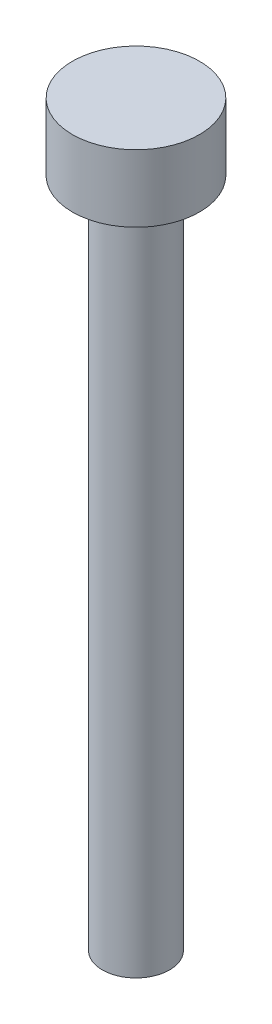
ISO-10303-21;
HEADER;
FILE_DESCRIPTION(('STEP AP214'),'2;1');
FILE_NAME('part.step','',(''),(''),'','','');
FILE_SCHEMA(('AUTOMOTIVE_DESIGN { 1 0 10303 214 1 1 1 1 }'));
ENDSEC;
DATA;
#1=APPLICATION_CONTEXT('core data for automotive mechanical design processes');
#2=APPLICATION_PROTOCOL_DEFINITION('international standard','automotive_design',2000,#1);
#3=PRODUCT_CONTEXT('',#1,'mechanical');
#4=PRODUCT('Part','Part','',(#3));
#5=PRODUCT_RELATED_PRODUCT_CATEGORY('part','',(#4));
#6=PRODUCT_DEFINITION_FORMATION('','',#4);
#7=PRODUCT_DEFINITION_CONTEXT('part definition',#1,'design');
#8=PRODUCT_DEFINITION('design','',#6,#7);
#9=PRODUCT_DEFINITION_SHAPE('','',#8);
#10=(LENGTH_UNIT() NAMED_UNIT(*) SI_UNIT(.MILLI.,.METRE.));
#11=(NAMED_UNIT(*) PLANE_ANGLE_UNIT() SI_UNIT($,.RADIAN.));
#12=(NAMED_UNIT(*) SI_UNIT($,.STERADIAN.) SOLID_ANGLE_UNIT());
#13=UNCERTAINTY_MEASURE_WITH_UNIT(LENGTH_MEASURE(1.E-05),#10,'distance_accuracy_value','');
#14=(GEOMETRIC_REPRESENTATION_CONTEXT(3) GLOBAL_UNCERTAINTY_ASSIGNED_CONTEXT((#13)) GLOBAL_UNIT_ASSIGNED_CONTEXT((#10,
#11,#12)) REPRESENTATION_CONTEXT('',''));
#15=CARTESIAN_POINT('',(0.,0.,0.));
#16=DIRECTION('',(0.,0.,1.));
#17=DIRECTION('',(1.,0.,0.));
#18=AXIS2_PLACEMENT_3D('',#15,#16,#17);
#19=CARTESIAN_POINT('',(0.,30.,0.));
#20=DIRECTION('',(0.,-1.,0.));
#21=DIRECTION('',(0.,0.,-1.));
#22=AXIS2_PLACEMENT_3D('',#19,#20,#21);
#23=CYLINDRICAL_SURFACE('',#22,1.5);
#24=CARTESIAN_POINT('',(0.,30.,0.));
#25=DIRECTION('',(0.,1.,0.));
#26=DIRECTION('',(0.,0.,1.));
#27=AXIS2_PLACEMENT_3D('',#24,#25,#26);
#28=CIRCLE('',#27,1.5);
#29=CARTESIAN_POINT('',(0.,30.,1.5));
#30=VERTEX_POINT('',#29);
#31=EDGE_CURVE('E10',#30,#30,#28,.T.);
#32=ORIENTED_EDGE('',*,*,#31,.F.);
#33=EDGE_LOOP('',(#32));
#34=FACE_BOUND('',#33,.T.);
#35=CARTESIAN_POINT('',(0.,0.,0.));
#36=DIRECTION('',(0.,1.,0.));
#37=DIRECTION('',(0.,0.,1.));
#38=AXIS2_PLACEMENT_3D('',#35,#36,#37);
#39=CIRCLE('',#38,1.5);
#40=CARTESIAN_POINT('',(0.,0.,1.5));
#41=VERTEX_POINT('',#40);
#42=EDGE_CURVE('E34',#41,#41,#39,.T.);
#43=ORIENTED_EDGE('',*,*,#42,.T.);
#44=EDGE_LOOP('',(#43));
#45=FACE_BOUND('',#44,.T.);
#46=ADVANCED_FACE('F31',(#34,#45),#23,.T.);
#47=CARTESIAN_POINT('',(0.,0.,0.));
#48=DIRECTION('',(0.,1.,0.));
#49=DIRECTION('',(0.,0.,1.));
#50=AXIS2_PLACEMENT_3D('',#47,#48,#49);
#51=PLANE('',#50);
#52=ORIENTED_EDGE('',*,*,#42,.F.);
#53=EDGE_LOOP('',(#52));
#54=FACE_BOUND('',#53,.T.);
#55=ADVANCED_FACE('F54',(#54),#51,.F.);
#56=CARTESIAN_POINT('',(0.,33.,0.));
#57=DIRECTION('',(0.,-1.,0.));
#58=DIRECTION('',(0.,0.,-1.));
#59=AXIS2_PLACEMENT_3D('',#56,#57,#58);
#60=CYLINDRICAL_SURFACE('',#59,2.84);
#61=CARTESIAN_POINT('',(0.,33.,0.));
#62=DIRECTION('',(0.,1.,0.));
#63=DIRECTION('',(0.,0.,1.));
#64=AXIS2_PLACEMENT_3D('',#61,#62,#63);
#65=CIRCLE('',#64,2.84);
#66=CARTESIAN_POINT('',(0.,33.,2.84));
#67=VERTEX_POINT('',#66);
#68=EDGE_CURVE('E41',#67,#67,#65,.T.);
#69=ORIENTED_EDGE('',*,*,#68,.F.);
#70=EDGE_LOOP('',(#69));
#71=FACE_BOUND('',#70,.T.);
#72=CARTESIAN_POINT('',(0.,30.,0.));
#73=DIRECTION('',(0.,1.,0.));
#74=DIRECTION('',(0.,0.,1.));
#75=AXIS2_PLACEMENT_3D('',#72,#73,#74);
#76=CIRCLE('',#75,2.84);
#77=CARTESIAN_POINT('',(0.,30.,2.84));
#78=VERTEX_POINT('',#77);
#79=EDGE_CURVE('E43',#78,#78,#76,.T.);
#80=ORIENTED_EDGE('',*,*,#79,.T.);
#81=EDGE_LOOP('',(#80));
#82=FACE_BOUND('',#81,.T.);
#83=ADVANCED_FACE('F51',(#71,#82),#60,.T.);
#84=CARTESIAN_POINT('',(0.,33.,0.));
#85=DIRECTION('',(0.,1.,0.));
#86=DIRECTION('',(0.,0.,1.));
#87=AXIS2_PLACEMENT_3D('',#84,#85,#86);
#88=PLANE('',#87);
#89=ORIENTED_EDGE('',*,*,#68,.T.);
#90=EDGE_LOOP('',(#89));
#91=FACE_BOUND('',#90,.T.);
#92=ADVANCED_FACE('F49',(#91),#88,.T.);
#93=CARTESIAN_POINT('',(0.,30.,0.));
#94=DIRECTION('',(0.,1.,0.));
#95=DIRECTION('',(0.,0.,1.));
#96=AXIS2_PLACEMENT_3D('',#93,#94,#95);
#97=PLANE('',#96);
#98=ORIENTED_EDGE('',*,*,#31,.T.);
#99=EDGE_LOOP('',(#98));
#100=FACE_BOUND('',#99,.T.);
#101=ORIENTED_EDGE('',*,*,#79,.F.);
#102=EDGE_LOOP('',(#101));
#103=FACE_BOUND('',#102,.T.);
#104=ADVANCED_FACE('F58',(#100,#103),#97,.F.);
#105=CLOSED_SHELL('',(#46,#55,#83,#92,#104));
#106=MANIFOLD_SOLID_BREP('B2',#105);
#107=ADVANCED_BREP_SHAPE_REPRESENTATION('',(#18,#106),#14);
#108=SHAPE_DEFINITION_REPRESENTATION(#9,#107);
ENDSEC;
END-ISO-10303-21;
